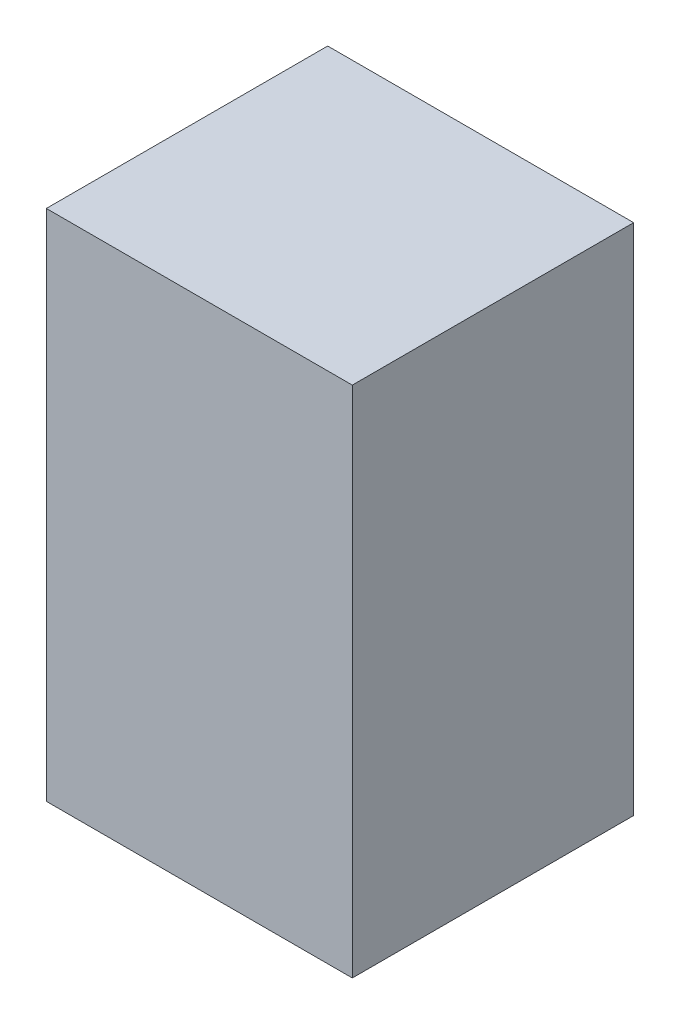
ISO-10303-21;
HEADER;
FILE_DESCRIPTION(('STEP AP214'),'2;1');
FILE_NAME('part.step','',(''),(''),'','','');
FILE_SCHEMA(('AUTOMOTIVE_DESIGN { 1 0 10303 214 1 1 1 1 }'));
ENDSEC;
DATA;
#1=APPLICATION_CONTEXT('core data for automotive mechanical design processes');
#2=APPLICATION_PROTOCOL_DEFINITION('international standard','automotive_design',2000,#1);
#3=PRODUCT_CONTEXT('',#1,'mechanical');
#4=PRODUCT('Part','Part','',(#3));
#5=PRODUCT_RELATED_PRODUCT_CATEGORY('part','',(#4));
#6=PRODUCT_DEFINITION_FORMATION('','',#4);
#7=PRODUCT_DEFINITION_CONTEXT('part definition',#1,'design');
#8=PRODUCT_DEFINITION('design','',#6,#7);
#9=PRODUCT_DEFINITION_SHAPE('','',#8);
#10=(LENGTH_UNIT() NAMED_UNIT(*) SI_UNIT(.MILLI.,.METRE.));
#11=(NAMED_UNIT(*) PLANE_ANGLE_UNIT() SI_UNIT($,.RADIAN.));
#12=(NAMED_UNIT(*) SI_UNIT($,.STERADIAN.) SOLID_ANGLE_UNIT());
#13=UNCERTAINTY_MEASURE_WITH_UNIT(LENGTH_MEASURE(1.E-05),#10,'distance_accuracy_value','');
#14=(GEOMETRIC_REPRESENTATION_CONTEXT(3) GLOBAL_UNCERTAINTY_ASSIGNED_CONTEXT((#13)) GLOBAL_UNIT_ASSIGNED_CONTEXT((#10,
#11,#12)) REPRESENTATION_CONTEXT('',''));
#15=CARTESIAN_POINT('',(0.,0.,0.));
#16=DIRECTION('',(0.,0.,1.));
#17=DIRECTION('',(1.,0.,0.));
#18=AXIS2_PLACEMENT_3D('',#15,#16,#17);
#19=CARTESIAN_POINT('',(2.17499946,3.65000286,3.99999962));
#20=DIRECTION('',(0.,0.,-1.));
#21=DIRECTION('',(-1.,0.,0.));
#22=AXIS2_PLACEMENT_3D('',#19,#20,#21);
#23=PLANE('',#22);
#24=DIRECTION('',(0.,1.,0.));
#25=VECTOR('',#24,1.);
#26=CARTESIAN_POINT('',(-2.17499946,3.65000286,3.99999962));
#27=LINE('',#26,#25);
#28=CARTESIAN_POINT('',(-2.17499946,3.65000286,3.99999962));
#29=VERTEX_POINT('',#28);
#30=CARTESIAN_POINT('',(-2.17499946,-3.65000032,3.99999962));
#31=VERTEX_POINT('',#30);
#32=EDGE_CURVE('E58',#29,#31,#27,.F.);
#33=ORIENTED_EDGE('',*,*,#32,.T.);
#34=DIRECTION('',(-1.,0.,0.));
#35=VECTOR('',#34,1.);
#36=CARTESIAN_POINT('',(2.17499946,-3.65000032,3.99999962));
#37=LINE('',#36,#35);
#38=CARTESIAN_POINT('',(2.17499438,-3.65000032,3.99999962));
#39=VERTEX_POINT('',#38);
#40=EDGE_CURVE('E55',#31,#39,#37,.F.);
#41=ORIENTED_EDGE('',*,*,#40,.T.);
#42=DIRECTION('',(6.95890106994632E-07,0.999999999999758,0.));
#43=VECTOR('',#42,1.);
#44=CARTESIAN_POINT('',(2.17499945999999,3.65000286,3.99999962));
#45=LINE('',#44,#43);
#46=CARTESIAN_POINT('',(2.17499946,3.65000286,3.99999962));
#47=VERTEX_POINT('',#46);
#48=EDGE_CURVE('E19',#39,#47,#45,.T.);
#49=ORIENTED_EDGE('',*,*,#48,.T.);
#50=DIRECTION('',(1.,0.,0.));
#51=VECTOR('',#50,1.);
#52=CARTESIAN_POINT('',(2.17499946,3.65000286,3.99999962));
#53=LINE('',#52,#51);
#54=EDGE_CURVE('E79',#47,#29,#53,.F.);
#55=ORIENTED_EDGE('',*,*,#54,.T.);
#56=EDGE_LOOP('',(#33,#41,#49,#55));
#57=FACE_BOUND('',#56,.T.);
#58=ADVANCED_FACE('F16',(#57),#23,.F.);
#59=CARTESIAN_POINT('',(2.17499438,-3.65000032,0.));
#60=DIRECTION('',(-0.999999999999758,6.95890106994632E-07,0.));
#61=DIRECTION('',(-6.95890106994632E-07,-0.999999999999758,0.));
#62=AXIS2_PLACEMENT_3D('',#59,#60,#61);
#63=PLANE('',#62);
#64=DIRECTION('',(0.,0.,-1.));
#65=VECTOR('',#64,1.);
#66=CARTESIAN_POINT('',(2.17499946,3.65000286,0.));
#67=LINE('',#66,#65);
#68=CARTESIAN_POINT('',(2.17499946,3.65000286,0.));
#69=VERTEX_POINT('',#68);
#70=EDGE_CURVE('E67',#69,#47,#67,.F.);
#71=ORIENTED_EDGE('',*,*,#70,.T.);
#72=ORIENTED_EDGE('',*,*,#48,.F.);
#73=DIRECTION('',(0.,0.,1.));
#74=VECTOR('',#73,1.);
#75=CARTESIAN_POINT('',(2.17499438,-3.65000032,0.));
#76=LINE('',#75,#74);
#77=CARTESIAN_POINT('',(2.17499438,-3.65000032,0.));
#78=VERTEX_POINT('',#77);
#79=EDGE_CURVE('E62',#39,#78,#76,.F.);
#80=ORIENTED_EDGE('',*,*,#79,.T.);
#81=DIRECTION('',(-6.95890106994632E-07,-0.999999999999758,0.));
#82=VECTOR('',#81,1.);
#83=CARTESIAN_POINT('',(2.17499438,-3.65000032,0.));
#84=LINE('',#83,#82);
#85=EDGE_CURVE('E87',#69,#78,#84,.T.);
#86=ORIENTED_EDGE('',*,*,#85,.F.);
#87=EDGE_LOOP('',(#71,#72,#80,#86));
#88=FACE_BOUND('',#87,.T.);
#89=ADVANCED_FACE('F64',(#88),#63,.F.);
#90=CARTESIAN_POINT('',(-2.17499946,-3.65000032,0.));
#91=DIRECTION('',(0.,1.,0.));
#92=DIRECTION('',(0.,0.,1.));
#93=AXIS2_PLACEMENT_3D('',#90,#91,#92);
#94=PLANE('',#93);
#95=ORIENTED_EDGE('',*,*,#79,.F.);
#96=ORIENTED_EDGE('',*,*,#40,.F.);
#97=DIRECTION('',(0.,0.,-1.));
#98=VECTOR('',#97,1.);
#99=CARTESIAN_POINT('',(-2.17499946,-3.65000032,0.));
#100=LINE('',#99,#98);
#101=CARTESIAN_POINT('',(-2.17499946,-3.65000032,0.));
#102=VERTEX_POINT('',#101);
#103=EDGE_CURVE('E74',#31,#102,#100,.T.);
#104=ORIENTED_EDGE('',*,*,#103,.T.);
#105=DIRECTION('',(-1.,0.,0.));
#106=VECTOR('',#105,1.);
#107=CARTESIAN_POINT('',(2.17499946,-3.65000032,0.));
#108=LINE('',#107,#106);
#109=EDGE_CURVE('E71',#78,#102,#108,.T.);
#110=ORIENTED_EDGE('',*,*,#109,.F.);
#111=EDGE_LOOP('',(#95,#96,#104,#110));
#112=FACE_BOUND('',#111,.T.);
#113=ADVANCED_FACE('F69',(#112),#94,.F.);
#114=CARTESIAN_POINT('',(-2.17499946,3.65000286,0.));
#115=DIRECTION('',(1.,0.,0.));
#116=DIRECTION('',(0.,0.,-1.));
#117=AXIS2_PLACEMENT_3D('',#114,#115,#116);
#118=PLANE('',#117);
#119=ORIENTED_EDGE('',*,*,#103,.F.);
#120=ORIENTED_EDGE('',*,*,#32,.F.);
#121=DIRECTION('',(0.,0.,-1.));
#122=VECTOR('',#121,1.);
#123=CARTESIAN_POINT('',(-2.17499946,3.65000286,0.));
#124=LINE('',#123,#122);
#125=CARTESIAN_POINT('',(-2.17499946,3.65000286,0.));
#126=VERTEX_POINT('',#125);
#127=EDGE_CURVE('E34',#29,#126,#124,.T.);
#128=ORIENTED_EDGE('',*,*,#127,.T.);
#129=DIRECTION('',(0.,1.,0.));
#130=VECTOR('',#129,1.);
#131=CARTESIAN_POINT('',(-2.17499946,3.65000286,0.));
#132=LINE('',#131,#130);
#133=EDGE_CURVE('E25',#102,#126,#132,.T.);
#134=ORIENTED_EDGE('',*,*,#133,.F.);
#135=EDGE_LOOP('',(#119,#120,#128,#134));
#136=FACE_BOUND('',#135,.T.);
#137=ADVANCED_FACE('F96',(#136),#118,.F.);
#138=CARTESIAN_POINT('',(2.17499946,3.65000286,0.));
#139=DIRECTION('',(0.,-1.,0.));
#140=DIRECTION('',(0.,0.,-1.));
#141=AXIS2_PLACEMENT_3D('',#138,#139,#140);
#142=PLANE('',#141);
#143=ORIENTED_EDGE('',*,*,#127,.F.);
#144=ORIENTED_EDGE('',*,*,#54,.F.);
#145=ORIENTED_EDGE('',*,*,#70,.F.);
#146=DIRECTION('',(-1.,0.,0.));
#147=VECTOR('',#146,1.);
#148=CARTESIAN_POINT('',(2.17499946,3.65000286,0.));
#149=LINE('',#148,#147);
#150=EDGE_CURVE('E11',#126,#69,#149,.F.);
#151=ORIENTED_EDGE('',*,*,#150,.F.);
#152=EDGE_LOOP('',(#143,#144,#145,#151));
#153=FACE_BOUND('',#152,.T.);
#154=ADVANCED_FACE('F95',(#153),#142,.F.);
#155=CARTESIAN_POINT('',(2.17499946,3.65000286,0.));
#156=DIRECTION('',(0.,0.,-1.));
#157=DIRECTION('',(-1.,0.,0.));
#158=AXIS2_PLACEMENT_3D('',#155,#156,#157);
#159=PLANE('',#158);
#160=ORIENTED_EDGE('',*,*,#133,.T.);
#161=ORIENTED_EDGE('',*,*,#150,.T.);
#162=ORIENTED_EDGE('',*,*,#85,.T.);
#163=ORIENTED_EDGE('',*,*,#109,.T.);
#164=EDGE_LOOP('',(#160,#161,#162,#163));
#165=FACE_BOUND('',#164,.T.);
#166=ADVANCED_FACE('F93',(#165),#159,.T.);
#167=CLOSED_SHELL('',(#58,#89,#113,#137,#154,#166));
#168=MANIFOLD_SOLID_BREP('B1',#167);
#169=ADVANCED_BREP_SHAPE_REPRESENTATION('',(#18,#168),#14);
#170=SHAPE_DEFINITION_REPRESENTATION(#9,#169);
ENDSEC;
END-ISO-10303-21;
